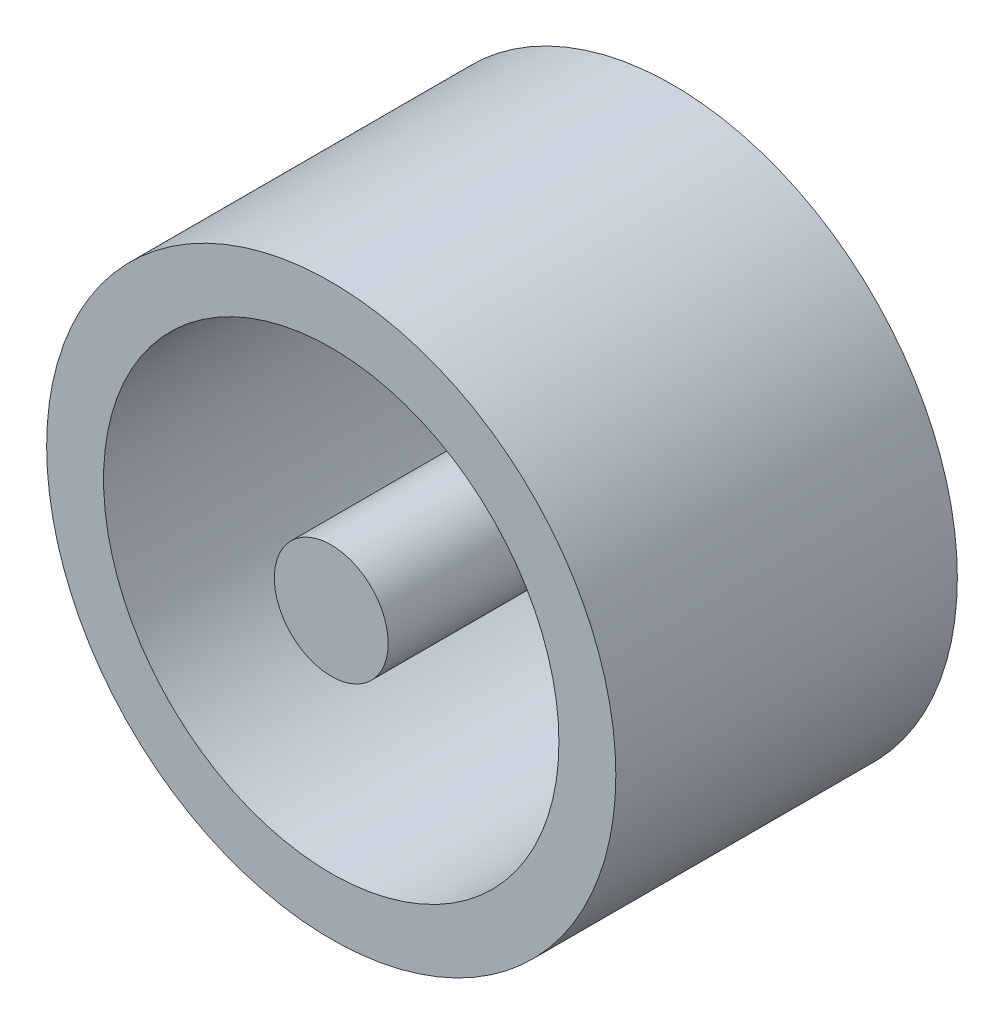
ISO-10303-21;
HEADER;
FILE_DESCRIPTION(('STEP AP214'),'2;1');
FILE_NAME('part.step','',(''),(''),'','','');
FILE_SCHEMA(('AUTOMOTIVE_DESIGN { 1 0 10303 214 1 1 1 1 }'));
ENDSEC;
DATA;
#1=APPLICATION_CONTEXT('core data for automotive mechanical design processes');
#2=APPLICATION_PROTOCOL_DEFINITION('international standard','automotive_design',2000,#1);
#3=PRODUCT_CONTEXT('',#1,'mechanical');
#4=PRODUCT('Part','Part','',(#3));
#5=PRODUCT_RELATED_PRODUCT_CATEGORY('part','',(#4));
#6=PRODUCT_DEFINITION_FORMATION('','',#4);
#7=PRODUCT_DEFINITION_CONTEXT('part definition',#1,'design');
#8=PRODUCT_DEFINITION('design','',#6,#7);
#9=PRODUCT_DEFINITION_SHAPE('','',#8);
#10=(LENGTH_UNIT() NAMED_UNIT(*) SI_UNIT(.MILLI.,.METRE.));
#11=(NAMED_UNIT(*) PLANE_ANGLE_UNIT() SI_UNIT($,.RADIAN.));
#12=(NAMED_UNIT(*) SI_UNIT($,.STERADIAN.) SOLID_ANGLE_UNIT());
#13=UNCERTAINTY_MEASURE_WITH_UNIT(LENGTH_MEASURE(1.E-05),#10,'distance_accuracy_value','');
#14=(GEOMETRIC_REPRESENTATION_CONTEXT(3) GLOBAL_UNCERTAINTY_ASSIGNED_CONTEXT((#13)) GLOBAL_UNIT_ASSIGNED_CONTEXT((#10,
#11,#12)) REPRESENTATION_CONTEXT('',''));
#15=CARTESIAN_POINT('',(0.,0.,0.));
#16=DIRECTION('',(0.,0.,1.));
#17=DIRECTION('',(1.,0.,0.));
#18=AXIS2_PLACEMENT_3D('',#15,#16,#17);
#19=CARTESIAN_POINT('',(0.,0.,1.5));
#20=DIRECTION('',(0.,0.,-1.));
#21=DIRECTION('',(-1.,0.,0.));
#22=AXIS2_PLACEMENT_3D('',#19,#20,#21);
#23=CYLINDRICAL_SURFACE('',#22,0.25);
#24=CARTESIAN_POINT('',(0.,0.,1.5));
#25=DIRECTION('',(0.,0.,1.));
#26=DIRECTION('',(1.,0.,0.));
#27=AXIS2_PLACEMENT_3D('',#24,#25,#26);
#28=CIRCLE('',#27,0.25);
#29=CARTESIAN_POINT('',(0.25,0.,1.5));
#30=VERTEX_POINT('',#29);
#31=EDGE_CURVE('E11',#30,#30,#28,.T.);
#32=ORIENTED_EDGE('',*,*,#31,.F.);
#33=EDGE_LOOP('',(#32));
#34=FACE_BOUND('',#33,.T.);
#35=CARTESIAN_POINT('',(0.,0.,0.));
#36=DIRECTION('',(0.,0.,1.));
#37=DIRECTION('',(1.,0.,0.));
#38=AXIS2_PLACEMENT_3D('',#35,#36,#37);
#39=CIRCLE('',#38,0.25);
#40=CARTESIAN_POINT('',(0.25,0.,0.));
#41=VERTEX_POINT('',#40);
#42=EDGE_CURVE('E41',#41,#41,#39,.T.);
#43=ORIENTED_EDGE('',*,*,#42,.T.);
#44=EDGE_LOOP('',(#43));
#45=FACE_BOUND('',#44,.T.);
#46=ADVANCED_FACE('F38',(#34,#45),#23,.T.);
#47=CARTESIAN_POINT('',(0.,0.,1.5));
#48=DIRECTION('',(0.,0.,1.));
#49=DIRECTION('',(1.,0.,0.));
#50=AXIS2_PLACEMENT_3D('',#47,#48,#49);
#51=PLANE('',#50);
#52=ORIENTED_EDGE('',*,*,#31,.T.);
#53=EDGE_LOOP('',(#52));
#54=FACE_BOUND('',#53,.T.);
#55=ADVANCED_FACE('F53',(#54),#51,.T.);
#56=CARTESIAN_POINT('',(0.,0.,0.));
#57=DIRECTION('',(0.,0.,1.));
#58=DIRECTION('',(1.,0.,0.));
#59=AXIS2_PLACEMENT_3D('',#56,#57,#58);
#60=PLANE('',#59);
#61=ORIENTED_EDGE('',*,*,#42,.F.);
#62=EDGE_LOOP('',(#61));
#63=FACE_BOUND('',#62,.T.);
#64=ADVANCED_FACE('F51',(#63),#60,.F.);
#65=CLOSED_SHELL('',(#46,#55,#64));
#66=MANIFOLD_SOLID_BREP('B2',#65);
#67=CARTESIAN_POINT('',(0.,0.,1.5));
#68=DIRECTION('',(0.,0.,1.));
#69=DIRECTION('',(1.,0.,0.));
#70=AXIS2_PLACEMENT_3D('',#67,#68,#69);
#71=PLANE('',#70);
#72=CARTESIAN_POINT('',(0.,0.,1.5));
#73=DIRECTION('',(0.,0.,1.));
#74=DIRECTION('',(1.,0.,0.));
#75=AXIS2_PLACEMENT_3D('',#72,#73,#74);
#76=CIRCLE('',#75,1.25);
#77=CARTESIAN_POINT('',(1.25,0.,1.5));
#78=VERTEX_POINT('',#77);
#79=EDGE_CURVE('E37',#78,#78,#76,.T.);
#80=ORIENTED_EDGE('',*,*,#79,.T.);
#81=EDGE_LOOP('',(#80));
#82=FACE_BOUND('',#81,.T.);
#83=CARTESIAN_POINT('',(0.,0.,1.5));
#84=DIRECTION('',(0.,0.,1.));
#85=DIRECTION('',(1.,0.,0.));
#86=AXIS2_PLACEMENT_3D('',#83,#84,#85);
#87=CIRCLE('',#86,1.);
#88=CARTESIAN_POINT('',(1.,0.,1.5));
#89=VERTEX_POINT('',#88);
#90=EDGE_CURVE('E89',#89,#89,#87,.T.);
#91=ORIENTED_EDGE('',*,*,#90,.F.);
#92=EDGE_LOOP('',(#91));
#93=FACE_BOUND('',#92,.T.);
#94=ADVANCED_FACE('F78',(#82,#93),#71,.T.);
#95=CARTESIAN_POINT('',(0.,0.,0.));
#96=DIRECTION('',(0.,0.,1.));
#97=DIRECTION('',(1.,0.,0.));
#98=AXIS2_PLACEMENT_3D('',#95,#96,#97);
#99=PLANE('',#98);
#100=CARTESIAN_POINT('',(0.,0.,0.));
#101=DIRECTION('',(0.,0.,1.));
#102=DIRECTION('',(1.,0.,0.));
#103=AXIS2_PLACEMENT_3D('',#100,#101,#102);
#104=CIRCLE('',#103,1.25);
#105=CARTESIAN_POINT('',(1.25,0.,0.));
#106=VERTEX_POINT('',#105);
#107=EDGE_CURVE('E82',#106,#106,#104,.T.);
#108=ORIENTED_EDGE('',*,*,#107,.F.);
#109=EDGE_LOOP('',(#108));
#110=FACE_BOUND('',#109,.T.);
#111=CARTESIAN_POINT('',(0.,0.,0.));
#112=DIRECTION('',(0.,0.,1.));
#113=DIRECTION('',(1.,0.,0.));
#114=AXIS2_PLACEMENT_3D('',#111,#112,#113);
#115=CIRCLE('',#114,1.);
#116=CARTESIAN_POINT('',(1.,0.,0.));
#117=VERTEX_POINT('',#116);
#118=EDGE_CURVE('E91',#117,#117,#115,.T.);
#119=ORIENTED_EDGE('',*,*,#118,.T.);
#120=EDGE_LOOP('',(#119));
#121=FACE_BOUND('',#120,.T.);
#122=ADVANCED_FACE('F101',(#110,#121),#99,.F.);
#123=CARTESIAN_POINT('',(0.,0.,1.5));
#124=DIRECTION('',(0.,0.,-1.));
#125=DIRECTION('',(-1.,0.,0.));
#126=AXIS2_PLACEMENT_3D('',#123,#124,#125);
#127=CYLINDRICAL_SURFACE('',#126,1.25);
#128=ORIENTED_EDGE('',*,*,#79,.F.);
#129=EDGE_LOOP('',(#128));
#130=FACE_BOUND('',#129,.T.);
#131=ORIENTED_EDGE('',*,*,#107,.T.);
#132=EDGE_LOOP('',(#131));
#133=FACE_BOUND('',#132,.T.);
#134=ADVANCED_FACE('F80',(#130,#133),#127,.T.);
#135=CARTESIAN_POINT('',(0.,0.,1.5));
#136=DIRECTION('',(0.,0.,-1.));
#137=DIRECTION('',(-1.,0.,0.));
#138=AXIS2_PLACEMENT_3D('',#135,#136,#137);
#139=CYLINDRICAL_SURFACE('',#138,1.);
#140=ORIENTED_EDGE('',*,*,#90,.T.);
#141=EDGE_LOOP('',(#140));
#142=FACE_BOUND('',#141,.T.);
#143=ORIENTED_EDGE('',*,*,#118,.F.);
#144=EDGE_LOOP('',(#143));
#145=FACE_BOUND('',#144,.T.);
#146=ADVANCED_FACE('F97',(#142,#145),#139,.F.);
#147=CLOSED_SHELL('',(#94,#122,#134,#146));
#148=MANIFOLD_SOLID_BREP('B6',#147);
#149=ADVANCED_BREP_SHAPE_REPRESENTATION('',(#18,#66,#148),#14);
#150=SHAPE_DEFINITION_REPRESENTATION(#9,#149);
ENDSEC;
END-ISO-10303-21;
